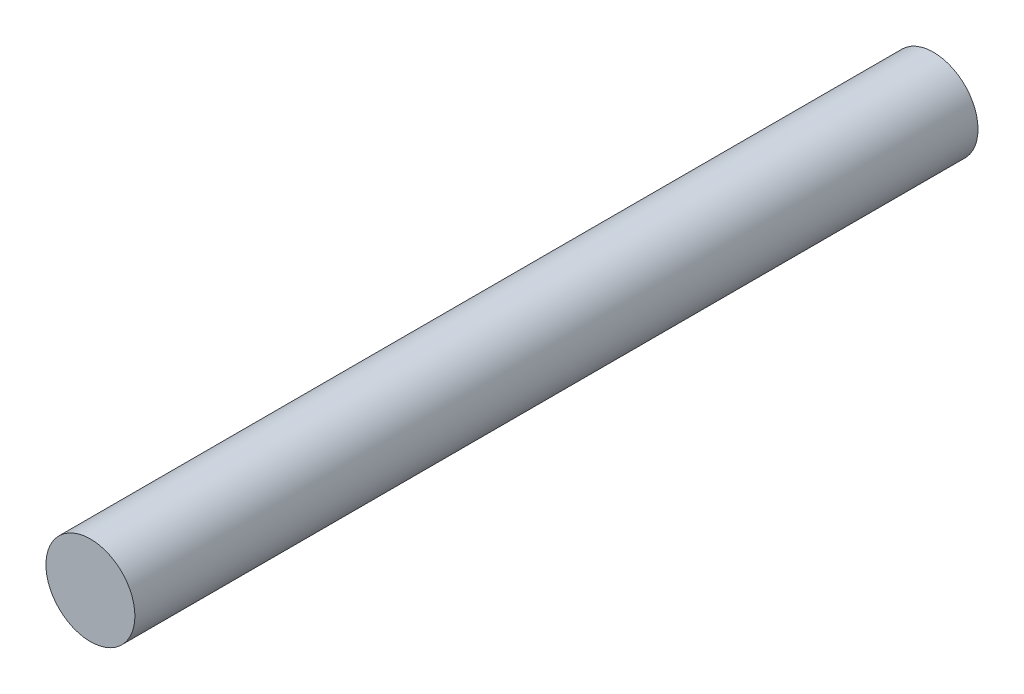
ISO-10303-21;
HEADER;
FILE_DESCRIPTION(('STEP AP214'),'2;1');
FILE_NAME('part.step','',(''),(''),'','','');
FILE_SCHEMA(('AUTOMOTIVE_DESIGN { 1 0 10303 214 1 1 1 1 }'));
ENDSEC;
DATA;
#1=APPLICATION_CONTEXT('core data for automotive mechanical design processes');
#2=APPLICATION_PROTOCOL_DEFINITION('international standard','automotive_design',2000,#1);
#3=PRODUCT_CONTEXT('',#1,'mechanical');
#4=PRODUCT('Part','Part','',(#3));
#5=PRODUCT_RELATED_PRODUCT_CATEGORY('part','',(#4));
#6=PRODUCT_DEFINITION_FORMATION('','',#4);
#7=PRODUCT_DEFINITION_CONTEXT('part definition',#1,'design');
#8=PRODUCT_DEFINITION('design','',#6,#7);
#9=PRODUCT_DEFINITION_SHAPE('','',#8);
#10=(LENGTH_UNIT() NAMED_UNIT(*) SI_UNIT(.MILLI.,.METRE.));
#11=(NAMED_UNIT(*) PLANE_ANGLE_UNIT() SI_UNIT($,.RADIAN.));
#12=(NAMED_UNIT(*) SI_UNIT($,.STERADIAN.) SOLID_ANGLE_UNIT());
#13=UNCERTAINTY_MEASURE_WITH_UNIT(LENGTH_MEASURE(1.E-05),#10,'distance_accuracy_value','');
#14=(GEOMETRIC_REPRESENTATION_CONTEXT(3) GLOBAL_UNCERTAINTY_ASSIGNED_CONTEXT((#13)) GLOBAL_UNIT_ASSIGNED_CONTEXT((#10,
#11,#12)) REPRESENTATION_CONTEXT('',''));
#15=CARTESIAN_POINT('',(0.,0.,0.));
#16=DIRECTION('',(0.,0.,1.));
#17=DIRECTION('',(1.,0.,0.));
#18=AXIS2_PLACEMENT_3D('',#15,#16,#17);
#19=CARTESIAN_POINT('',(0.,0.,90.));
#20=DIRECTION('',(0.,0.,-1.));
#21=DIRECTION('',(-1.,0.,0.));
#22=AXIS2_PLACEMENT_3D('',#19,#20,#21);
#23=CYLINDRICAL_SURFACE('',#22,4.75);
#24=CARTESIAN_POINT('',(0.,0.,90.));
#25=DIRECTION('',(0.,0.,1.));
#26=DIRECTION('',(1.,0.,0.));
#27=AXIS2_PLACEMENT_3D('',#24,#25,#26);
#28=CIRCLE('',#27,4.75);
#29=CARTESIAN_POINT('',(4.75,0.,90.));
#30=VERTEX_POINT('',#29);
#31=EDGE_CURVE('E10',#30,#30,#28,.T.);
#32=ORIENTED_EDGE('',*,*,#31,.F.);
#33=EDGE_LOOP('',(#32));
#34=FACE_BOUND('',#33,.T.);
#35=CARTESIAN_POINT('',(0.,0.,0.));
#36=DIRECTION('',(0.,0.,1.));
#37=DIRECTION('',(1.,0.,0.));
#38=AXIS2_PLACEMENT_3D('',#35,#36,#37);
#39=CIRCLE('',#38,4.75);
#40=CARTESIAN_POINT('',(4.75,0.,0.));
#41=VERTEX_POINT('',#40);
#42=EDGE_CURVE('E46',#41,#41,#39,.T.);
#43=ORIENTED_EDGE('',*,*,#42,.T.);
#44=EDGE_LOOP('',(#43));
#45=FACE_BOUND('',#44,.T.);
#46=ADVANCED_FACE('F43',(#34,#45),#23,.T.);
#47=CARTESIAN_POINT('',(0.,0.,90.));
#48=DIRECTION('',(0.,0.,1.));
#49=DIRECTION('',(1.,0.,0.));
#50=AXIS2_PLACEMENT_3D('',#47,#48,#49);
#51=PLANE('',#50);
#52=ORIENTED_EDGE('',*,*,#31,.T.);
#53=EDGE_LOOP('',(#52));
#54=FACE_BOUND('',#53,.T.);
#55=ADVANCED_FACE('F60',(#54),#51,.T.);
#56=CARTESIAN_POINT('',(0.,0.,0.));
#57=DIRECTION('',(0.,0.,1.));
#58=DIRECTION('',(1.,0.,0.));
#59=AXIS2_PLACEMENT_3D('',#56,#57,#58);
#60=PLANE('',#59);
#61=ORIENTED_EDGE('',*,*,#42,.F.);
#62=EDGE_LOOP('',(#61));
#63=FACE_BOUND('',#62,.T.);
#64=ADVANCED_FACE('F58',(#63),#60,.F.);
#65=CLOSED_SHELL('',(#46,#55,#64));
#66=MANIFOLD_SOLID_BREP('B2',#65);
#67=ADVANCED_BREP_SHAPE_REPRESENTATION('',(#18,#66),#14);
#68=SHAPE_DEFINITION_REPRESENTATION(#9,#67);
ENDSEC;
END-ISO-10303-21;
